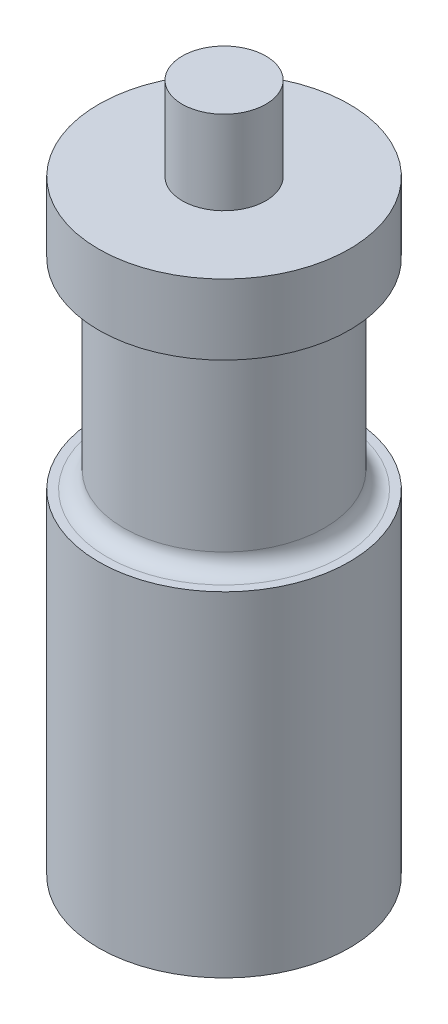
ISO-10303-21;
HEADER;
FILE_DESCRIPTION(('STEP AP214'),'2;1');
FILE_NAME('part.step','',(''),(''),'','','');
FILE_SCHEMA(('AUTOMOTIVE_DESIGN { 1 0 10303 214 1 1 1 1 }'));
ENDSEC;
DATA;
#1=APPLICATION_CONTEXT('core data for automotive mechanical design processes');
#2=APPLICATION_PROTOCOL_DEFINITION('international standard','automotive_design',2000,#1);
#3=PRODUCT_CONTEXT('',#1,'mechanical');
#4=PRODUCT('Part','Part','',(#3));
#5=PRODUCT_RELATED_PRODUCT_CATEGORY('part','',(#4));
#6=PRODUCT_DEFINITION_FORMATION('','',#4);
#7=PRODUCT_DEFINITION_CONTEXT('part definition',#1,'design');
#8=PRODUCT_DEFINITION('design','',#6,#7);
#9=PRODUCT_DEFINITION_SHAPE('','',#8);
#10=(LENGTH_UNIT() NAMED_UNIT(*) SI_UNIT(.MILLI.,.METRE.));
#11=(NAMED_UNIT(*) PLANE_ANGLE_UNIT() SI_UNIT($,.RADIAN.));
#12=(NAMED_UNIT(*) SI_UNIT($,.STERADIAN.) SOLID_ANGLE_UNIT());
#13=UNCERTAINTY_MEASURE_WITH_UNIT(LENGTH_MEASURE(1.E-05),#10,'distance_accuracy_value','');
#14=(GEOMETRIC_REPRESENTATION_CONTEXT(3) GLOBAL_UNCERTAINTY_ASSIGNED_CONTEXT((#13)) GLOBAL_UNIT_ASSIGNED_CONTEXT((#10,
#11,#12)) REPRESENTATION_CONTEXT('',''));
#15=CARTESIAN_POINT('',(0.,0.,0.));
#16=DIRECTION('',(0.,0.,1.));
#17=DIRECTION('',(1.,0.,0.));
#18=AXIS2_PLACEMENT_3D('',#15,#16,#17);
#19=CARTESIAN_POINT('',(0.,0.,0.));
#20=DIRECTION('',(0.,1.,0.));
#21=DIRECTION('',(0.,0.,1.));
#22=AXIS2_PLACEMENT_3D('',#19,#20,#21);
#23=PLANE('',#22);
#24=CARTESIAN_POINT('',(0.,0.,0.));
#25=DIRECTION('',(0.,1.,0.));
#26=DIRECTION('',(0.,0.,1.));
#27=AXIS2_PLACEMENT_3D('',#24,#25,#26);
#28=CIRCLE('',#27,7.);
#29=CARTESIAN_POINT('',(0.,0.,7.));
#30=VERTEX_POINT('',#29);
#31=EDGE_CURVE('E10',#30,#30,#28,.F.);
#32=ORIENTED_EDGE('',*,*,#31,.T.);
#33=EDGE_LOOP('',(#32));
#34=FACE_BOUND('',#33,.T.);
#35=CARTESIAN_POINT('',(0.,0.,0.));
#36=DIRECTION('',(0.,1.,0.));
#37=DIRECTION('',(0.,0.,1.));
#38=AXIS2_PLACEMENT_3D('',#35,#36,#37);
#39=CIRCLE('',#38,7.5);
#40=CARTESIAN_POINT('',(0.,0.,7.5));
#41=VERTEX_POINT('',#40);
#42=EDGE_CURVE('E53',#41,#41,#39,.T.);
#43=ORIENTED_EDGE('',*,*,#42,.T.);
#44=EDGE_LOOP('',(#43));
#45=FACE_BOUND('',#44,.T.);
#46=ADVANCED_FACE('F33',(#34,#45),#23,.T.);
#47=CARTESIAN_POINT('',(0.,25.2693154621623,0.));
#48=DIRECTION('',(0.,1.,0.));
#49=DIRECTION('',(0.,0.,1.));
#50=AXIS2_PLACEMENT_3D('',#47,#48,#49);
#51=CYLINDRICAL_SURFACE('',#50,7.5);
#52=CARTESIAN_POINT('',(0.,-20.,0.));
#53=DIRECTION('',(0.,1.,0.));
#54=DIRECTION('',(0.,0.,1.));
#55=AXIS2_PLACEMENT_3D('',#52,#53,#54);
#56=CIRCLE('',#55,7.5);
#57=CARTESIAN_POINT('',(0.,-20.,7.5));
#58=VERTEX_POINT('',#57);
#59=EDGE_CURVE('E56',#58,#58,#56,.T.);
#60=ORIENTED_EDGE('',*,*,#59,.T.);
#61=EDGE_LOOP('',(#60));
#62=FACE_BOUND('',#61,.T.);
#63=ORIENTED_EDGE('',*,*,#42,.F.);
#64=EDGE_LOOP('',(#63));
#65=FACE_BOUND('',#64,.T.);
#66=ADVANCED_FACE('F89',(#62,#65),#51,.T.);
#67=CARTESIAN_POINT('',(0.,-20.,0.));
#68=DIRECTION('',(0.,1.,0.));
#69=DIRECTION('',(0.,0.,1.));
#70=AXIS2_PLACEMENT_3D('',#67,#68,#69);
#71=PLANE('',#70);
#72=ORIENTED_EDGE('',*,*,#59,.F.);
#73=EDGE_LOOP('',(#72));
#74=FACE_BOUND('',#73,.T.);
#75=ADVANCED_FACE('F94',(#74),#71,.F.);
#76=CARTESIAN_POINT('',(0.,21.2,0.));
#77=DIRECTION('',(0.,1.,0.));
#78=DIRECTION('',(0.,0.,1.));
#79=AXIS2_PLACEMENT_3D('',#76,#77,#78);
#80=PLANE('',#79);
#81=CARTESIAN_POINT('',(0.,21.2,0.));
#82=DIRECTION('',(0.,1.,0.));
#83=DIRECTION('',(0.,0.,1.));
#84=AXIS2_PLACEMENT_3D('',#81,#82,#83);
#85=CIRCLE('',#84,2.5);
#86=CARTESIAN_POINT('',(0.,21.2,2.5));
#87=VERTEX_POINT('',#86);
#88=EDGE_CURVE('E59',#87,#87,#85,.T.);
#89=ORIENTED_EDGE('',*,*,#88,.T.);
#90=EDGE_LOOP('',(#89));
#91=FACE_BOUND('',#90,.T.);
#92=ADVANCED_FACE('F159',(#91),#80,.T.);
#93=CARTESIAN_POINT('',(0.,25.2693154621623,0.));
#94=DIRECTION('',(0.,1.,0.));
#95=DIRECTION('',(0.,0.,1.));
#96=AXIS2_PLACEMENT_3D('',#93,#94,#95);
#97=CYLINDRICAL_SURFACE('',#96,2.5);
#98=ORIENTED_EDGE('',*,*,#88,.F.);
#99=EDGE_LOOP('',(#98));
#100=FACE_BOUND('',#99,.T.);
#101=CARTESIAN_POINT('',(0.,16.2,0.));
#102=DIRECTION('',(0.,1.,0.));
#103=DIRECTION('',(0.,0.,1.));
#104=AXIS2_PLACEMENT_3D('',#101,#102,#103);
#105=CIRCLE('',#104,2.5);
#106=CARTESIAN_POINT('',(0.,16.2,2.5));
#107=VERTEX_POINT('',#106);
#108=EDGE_CURVE('E62',#107,#107,#105,.T.);
#109=ORIENTED_EDGE('',*,*,#108,.T.);
#110=EDGE_LOOP('',(#109));
#111=FACE_BOUND('',#110,.T.);
#112=ADVANCED_FACE('F148',(#100,#111),#97,.T.);
#113=CARTESIAN_POINT('',(0.,16.2,0.));
#114=DIRECTION('',(0.,1.,0.));
#115=DIRECTION('',(0.,0.,1.));
#116=AXIS2_PLACEMENT_3D('',#113,#114,#115);
#117=PLANE('',#116);
#118=CARTESIAN_POINT('',(0.,16.2,0.));
#119=DIRECTION('',(0.,1.,0.));
#120=DIRECTION('',(0.,0.,1.));
#121=AXIS2_PLACEMENT_3D('',#118,#119,#120);
#122=CIRCLE('',#121,7.5);
#123=CARTESIAN_POINT('',(0.,16.2,7.5));
#124=VERTEX_POINT('',#123);
#125=EDGE_CURVE('E65',#124,#124,#122,.T.);
#126=ORIENTED_EDGE('',*,*,#125,.T.);
#127=EDGE_LOOP('',(#126));
#128=FACE_BOUND('',#127,.T.);
#129=ORIENTED_EDGE('',*,*,#108,.F.);
#130=EDGE_LOOP('',(#129));
#131=FACE_BOUND('',#130,.T.);
#132=ADVANCED_FACE('F85',(#128,#131),#117,.T.);
#133=CARTESIAN_POINT('',(0.,25.2693154621623,0.));
#134=DIRECTION('',(0.,1.,0.));
#135=DIRECTION('',(0.,0.,1.));
#136=AXIS2_PLACEMENT_3D('',#133,#134,#135);
#137=CYLINDRICAL_SURFACE('',#136,7.5);
#138=ORIENTED_EDGE('',*,*,#125,.F.);
#139=EDGE_LOOP('',(#138));
#140=FACE_BOUND('',#139,.T.);
#141=CARTESIAN_POINT('',(0.,12.,0.));
#142=DIRECTION('',(0.,1.,0.));
#143=DIRECTION('',(0.,0.,1.));
#144=AXIS2_PLACEMENT_3D('',#141,#142,#143);
#145=CIRCLE('',#144,7.5);
#146=CARTESIAN_POINT('',(0.,12.,7.5));
#147=VERTEX_POINT('',#146);
#148=EDGE_CURVE('E68',#147,#147,#145,.T.);
#149=ORIENTED_EDGE('',*,*,#148,.T.);
#150=EDGE_LOOP('',(#149));
#151=FACE_BOUND('',#150,.T.);
#152=ADVANCED_FACE('F72',(#140,#151),#137,.T.);
#153=CARTESIAN_POINT('',(0.,12.,0.));
#154=DIRECTION('',(0.,1.,0.));
#155=DIRECTION('',(0.,0.,1.));
#156=AXIS2_PLACEMENT_3D('',#153,#154,#155);
#157=PLANE('',#156);
#158=CARTESIAN_POINT('',(0.,12.,0.));
#159=DIRECTION('',(0.,1.,0.));
#160=DIRECTION('',(0.,0.,1.));
#161=AXIS2_PLACEMENT_3D('',#158,#159,#160);
#162=CIRCLE('',#161,7.);
#163=CARTESIAN_POINT('',(0.,12.,7.));
#164=VERTEX_POINT('',#163);
#165=EDGE_CURVE('E48',#164,#164,#162,.T.);
#166=ORIENTED_EDGE('',*,*,#165,.T.);
#167=EDGE_LOOP('',(#166));
#168=FACE_BOUND('',#167,.T.);
#169=ORIENTED_EDGE('',*,*,#148,.F.);
#170=EDGE_LOOP('',(#169));
#171=FACE_BOUND('',#170,.T.);
#172=ADVANCED_FACE('F74',(#168,#171),#157,.F.);
#173=CARTESIAN_POINT('',(0.,25.2693154621623,0.));
#174=DIRECTION('',(0.,1.,0.));
#175=DIRECTION('',(0.,0.,1.));
#176=AXIS2_PLACEMENT_3D('',#173,#174,#175);
#177=CYLINDRICAL_SURFACE('',#176,6.);
#178=CARTESIAN_POINT('',(0.,11.,0.));
#179=DIRECTION('',(0.,1.,0.));
#180=DIRECTION('',(0.,0.,1.));
#181=AXIS2_PLACEMENT_3D('',#178,#179,#180);
#182=CIRCLE('',#181,6.);
#183=CARTESIAN_POINT('',(0.,11.,6.));
#184=VERTEX_POINT('',#183);
#185=EDGE_CURVE('E40',#184,#184,#182,.F.);
#186=ORIENTED_EDGE('',*,*,#185,.T.);
#187=EDGE_LOOP('',(#186));
#188=FACE_BOUND('',#187,.T.);
#189=CARTESIAN_POINT('',(0.,1.,0.));
#190=DIRECTION('',(0.,1.,0.));
#191=DIRECTION('',(0.,0.,1.));
#192=AXIS2_PLACEMENT_3D('',#189,#190,#191);
#193=CIRCLE('',#192,6.);
#194=CARTESIAN_POINT('',(0.,1.,6.));
#195=VERTEX_POINT('',#194);
#196=EDGE_CURVE('E44',#195,#195,#193,.T.);
#197=ORIENTED_EDGE('',*,*,#196,.T.);
#198=EDGE_LOOP('',(#197));
#199=FACE_BOUND('',#198,.T.);
#200=ADVANCED_FACE('F76',(#188,#199),#177,.T.);
#201=CARTESIAN_POINT('',(0.,11.,0.));
#202=DIRECTION('',(0.,1.,0.));
#203=DIRECTION('',(0.,0.,1.));
#204=AXIS2_PLACEMENT_3D('',#201,#202,#203);
#205=TOROIDAL_SURFACE('',#204,7.,1.);
#206=ORIENTED_EDGE('',*,*,#185,.F.);
#207=EDGE_LOOP('',(#206));
#208=FACE_BOUND('',#207,.T.);
#209=ORIENTED_EDGE('',*,*,#165,.F.);
#210=EDGE_LOOP('',(#209));
#211=FACE_BOUND('',#210,.T.);
#212=ADVANCED_FACE('F83',(#208,#211),#205,.F.);
#213=CARTESIAN_POINT('',(0.,1.,0.));
#214=DIRECTION('',(0.,1.,0.));
#215=DIRECTION('',(0.,0.,1.));
#216=AXIS2_PLACEMENT_3D('',#213,#214,#215);
#217=TOROIDAL_SURFACE('',#216,7.,1.);
#218=ORIENTED_EDGE('',*,*,#31,.F.);
#219=EDGE_LOOP('',(#218));
#220=FACE_BOUND('',#219,.T.);
#221=ORIENTED_EDGE('',*,*,#196,.F.);
#222=EDGE_LOOP('',(#221));
#223=FACE_BOUND('',#222,.T.);
#224=ADVANCED_FACE('F35',(#220,#223),#217,.F.);
#225=CLOSED_SHELL('',(#46,#66,#75,#92,#112,#132,#152,#172,#200,#212,#224));
#226=MANIFOLD_SOLID_BREP('B2',#225);
#227=ADVANCED_BREP_SHAPE_REPRESENTATION('',(#18,#226),#14);
#228=SHAPE_DEFINITION_REPRESENTATION(#9,#227);
ENDSEC;
END-ISO-10303-21;
